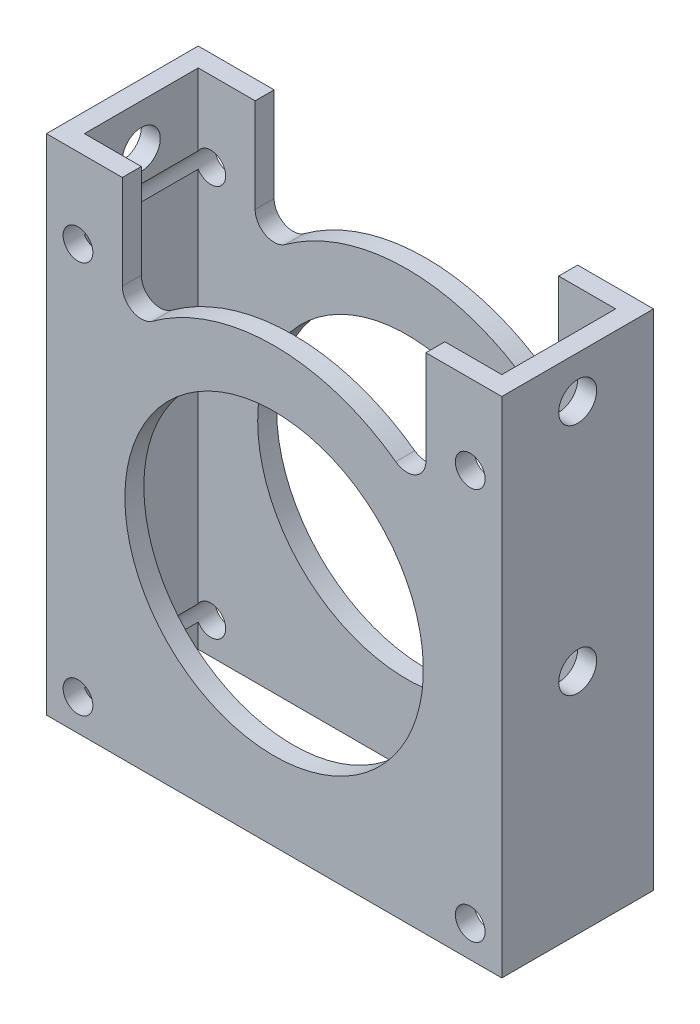
ISO-10303-21;
HEADER;
FILE_DESCRIPTION(('STEP AP214'),'2;1');
FILE_NAME('part.step','',(''),(''),'','','');
FILE_SCHEMA(('AUTOMOTIVE_DESIGN { 1 0 10303 214 1 1 1 1 }'));
ENDSEC;
DATA;
#1=APPLICATION_CONTEXT('core data for automotive mechanical design processes');
#2=APPLICATION_PROTOCOL_DEFINITION('international standard','automotive_design',2000,#1);
#3=PRODUCT_CONTEXT('',#1,'mechanical');
#4=PRODUCT('Part','Part','',(#3));
#5=PRODUCT_RELATED_PRODUCT_CATEGORY('part','',(#4));
#6=PRODUCT_DEFINITION_FORMATION('','',#4);
#7=PRODUCT_DEFINITION_CONTEXT('part definition',#1,'design');
#8=PRODUCT_DEFINITION('design','',#6,#7);
#9=PRODUCT_DEFINITION_SHAPE('','',#8);
#10=(LENGTH_UNIT() NAMED_UNIT(*) SI_UNIT(.MILLI.,.METRE.));
#11=(NAMED_UNIT(*) PLANE_ANGLE_UNIT() SI_UNIT($,.RADIAN.));
#12=(NAMED_UNIT(*) SI_UNIT($,.STERADIAN.) SOLID_ANGLE_UNIT());
#13=UNCERTAINTY_MEASURE_WITH_UNIT(LENGTH_MEASURE(1.E-05),#10,'distance_accuracy_value','');
#14=(GEOMETRIC_REPRESENTATION_CONTEXT(3) GLOBAL_UNCERTAINTY_ASSIGNED_CONTEXT((#13)) GLOBAL_UNIT_ASSIGNED_CONTEXT((#10,
#11,#12)) REPRESENTATION_CONTEXT('',''));
#15=CARTESIAN_POINT('',(0.,0.,0.));
#16=DIRECTION('',(0.,0.,1.));
#17=DIRECTION('',(1.,0.,0.));
#18=AXIS2_PLACEMENT_3D('',#15,#16,#17);
#19=CARTESIAN_POINT('',(3.175,49.276,0.));
#20=DIRECTION('',(1.,0.,0.));
#21=DIRECTION('',(0.,0.,-1.));
#22=AXIS2_PLACEMENT_3D('',#19,#20,#21);
#23=PLANE('',#22);
#24=DIRECTION('',(0.,-1.,0.));
#25=VECTOR('',#24,1.);
#26=CARTESIAN_POINT('',(3.175,49.276,-22.225));
#27=LINE('',#26,#25);
#28=CARTESIAN_POINT('',(3.175,-45.3162838117635,-22.225));
#29=VERTEX_POINT('',#28);
#30=CARTESIAN_POINT('',(3.175,-49.276,-22.225));
#31=VERTEX_POINT('',#30);
#32=EDGE_CURVE('E274',#29,#31,#27,.T.);
#33=ORIENTED_EDGE('',*,*,#32,.F.);
#34=DIRECTION('',(0.,0.,-1.));
#35=VECTOR('',#34,1.);
#36=CARTESIAN_POINT('',(3.175,-45.3162838117635,27.178));
#37=LINE('',#36,#35);
#38=CARTESIAN_POINT('',(3.175,-45.3162838117635,-3.175));
#39=VERTEX_POINT('',#38);
#40=EDGE_CURVE('E86',#29,#39,#37,.F.);
#41=ORIENTED_EDGE('',*,*,#40,.T.);
#42=DIRECTION('',(0.,-1.,0.));
#43=VECTOR('',#42,1.);
#44=CARTESIAN_POINT('',(3.175,49.276,-3.175));
#45=LINE('',#44,#43);
#46=CARTESIAN_POINT('',(3.175,-49.276,-3.175));
#47=VERTEX_POINT('',#46);
#48=EDGE_CURVE('E293',#39,#47,#45,.T.);
#49=ORIENTED_EDGE('',*,*,#48,.T.);
#50=DIRECTION('',(0.,0.,1.));
#51=VECTOR('',#50,1.);
#52=CARTESIAN_POINT('',(3.175,-49.276,0.));
#53=LINE('',#52,#51);
#54=EDGE_CURVE('E545',#31,#47,#53,.T.);
#55=ORIENTED_EDGE('',*,*,#54,.F.);
#56=EDGE_LOOP('',(#33,#41,#49,#55));
#57=FACE_BOUND('',#56,.T.);
#58=ADVANCED_FACE('F63',(#57),#23,.T.);
#59=CARTESIAN_POINT('',(3.175,-11.176,-12.7));
#60=DIRECTION('',(1.,0.,0.));
#61=DIRECTION('',(0.,0.,-1.));
#62=AXIS2_PLACEMENT_3D('',#59,#60,#61);
#63=CIRCLE('',#62,3.175);
#64=CARTESIAN_POINT('',(3.175,-11.176,-15.875));
#65=VERTEX_POINT('',#64);
#66=EDGE_CURVE('E763',#65,#65,#63,.T.);
#67=ORIENTED_EDGE('',*,*,#66,.F.);
#68=EDGE_LOOP('',(#67));
#69=FACE_BOUND('',#68,.T.);
#70=CARTESIAN_POINT('',(3.175,20.3173161882365,-3.175));
#71=VERTEX_POINT('',#70);
#72=CARTESIAN_POINT('',(3.175,-42.6693161882365,-3.175));
#73=VERTEX_POINT('',#72);
#74=EDGE_CURVE('E262',#71,#73,#45,.T.);
#75=ORIENTED_EDGE('',*,*,#74,.T.);
#76=DIRECTION('',(0.,0.,-1.));
#77=VECTOR('',#76,1.);
#78=CARTESIAN_POINT('',(3.175,-42.6693161882365,27.178));
#79=LINE('',#78,#77);
#80=CARTESIAN_POINT('',(3.175,-42.6693161882365,-22.225));
#81=VERTEX_POINT('',#80);
#82=EDGE_CURVE('E248',#73,#81,#79,.T.);
#83=ORIENTED_EDGE('',*,*,#82,.T.);
#84=CARTESIAN_POINT('',(3.175,20.3173161882365,-22.225));
#85=VERTEX_POINT('',#84);
#86=EDGE_CURVE('E260',#85,#81,#27,.T.);
#87=ORIENTED_EDGE('',*,*,#86,.F.);
#88=DIRECTION('',(0.,0.,-1.));
#89=VECTOR('',#88,1.);
#90=CARTESIAN_POINT('',(3.175,20.3173161882365,27.178));
#91=LINE('',#90,#89);
#92=EDGE_CURVE('E535',#71,#85,#91,.T.);
#93=ORIENTED_EDGE('',*,*,#92,.F.);
#94=EDGE_LOOP('',(#75,#83,#87,#93));
#95=FACE_BOUND('',#94,.T.);
#96=ADVANCED_FACE('F258',(#69,#95),#23,.T.);
#97=CARTESIAN_POINT('',(73.025,49.276,0.));
#98=DIRECTION('',(-1.,0.,0.));
#99=DIRECTION('',(0.,0.,1.));
#100=AXIS2_PLACEMENT_3D('',#97,#98,#99);
#101=PLANE('',#100);
#102=CARTESIAN_POINT('',(73.025,27.94,-12.7));
#103=DIRECTION('',(-1.,0.,0.));
#104=DIRECTION('',(0.,0.,1.));
#105=AXIS2_PLACEMENT_3D('',#102,#103,#104);
#106=CIRCLE('',#105,3.175);
#107=CARTESIAN_POINT('',(73.025,27.94,-9.525));
#108=VERTEX_POINT('',#107);
#109=EDGE_CURVE('E364',#108,#108,#106,.T.);
#110=ORIENTED_EDGE('',*,*,#109,.F.);
#111=EDGE_LOOP('',(#110));
#112=FACE_BOUND('',#111,.T.);
#113=DIRECTION('',(0.,-1.,0.));
#114=VECTOR('',#113,1.);
#115=CARTESIAN_POINT('',(73.025,49.276,-22.225));
#116=LINE('',#115,#114);
#117=CARTESIAN_POINT('',(73.025,34.9885,-22.225));
#118=VERTEX_POINT('',#117);
#119=CARTESIAN_POINT('',(73.025,22.9642838117635,-22.225));
#120=VERTEX_POINT('',#119);
#121=EDGE_CURVE('E283',#118,#120,#116,.T.);
#122=ORIENTED_EDGE('',*,*,#121,.T.);
#123=DIRECTION('',(0.,0.,-1.));
#124=VECTOR('',#123,1.);
#125=CARTESIAN_POINT('',(73.025,22.9642838117635,27.178));
#126=LINE('',#125,#124);
#127=CARTESIAN_POINT('',(73.025,22.9642838117635,-3.175));
#128=VERTEX_POINT('',#127);
#129=EDGE_CURVE('E79',#120,#128,#126,.F.);
#130=ORIENTED_EDGE('',*,*,#129,.T.);
#131=DIRECTION('',(0.,-1.,0.));
#132=VECTOR('',#131,1.);
#133=CARTESIAN_POINT('',(73.025,49.276,-3.175));
#134=LINE('',#133,#132);
#135=CARTESIAN_POINT('',(73.025,34.9885,-3.175));
#136=VERTEX_POINT('',#135);
#137=EDGE_CURVE('E289',#136,#128,#134,.T.);
#138=ORIENTED_EDGE('',*,*,#137,.F.);
#139=DIRECTION('',(0.,0.,1.));
#140=VECTOR('',#139,1.);
#141=CARTESIAN_POINT('',(73.025,34.9885,0.));
#142=LINE('',#141,#140);
#143=EDGE_CURVE('E435',#118,#136,#142,.T.);
#144=ORIENTED_EDGE('',*,*,#143,.F.);
#145=EDGE_LOOP('',(#122,#130,#138,#144));
#146=FACE_BOUND('',#145,.T.);
#147=ADVANCED_FACE('F669',(#112,#146),#101,.T.);
#148=CARTESIAN_POINT('',(73.025,-11.176,-12.7));
#149=DIRECTION('',(-1.,0.,0.));
#150=DIRECTION('',(0.,0.,1.));
#151=AXIS2_PLACEMENT_3D('',#148,#149,#150);
#152=CIRCLE('',#151,3.175);
#153=CARTESIAN_POINT('',(73.025,-11.176,-9.525));
#154=VERTEX_POINT('',#153);
#155=EDGE_CURVE('E760',#154,#154,#152,.T.);
#156=ORIENTED_EDGE('',*,*,#155,.F.);
#157=EDGE_LOOP('',(#156));
#158=FACE_BOUND('',#157,.T.);
#159=CARTESIAN_POINT('',(73.025,20.3173161882365,-3.175));
#160=VERTEX_POINT('',#159);
#161=CARTESIAN_POINT('',(73.025,-42.6693161882365,-3.175));
#162=VERTEX_POINT('',#161);
#163=EDGE_CURVE('E294',#160,#162,#134,.T.);
#164=ORIENTED_EDGE('',*,*,#163,.F.);
#165=DIRECTION('',(0.,0.,-1.));
#166=VECTOR('',#165,1.);
#167=CARTESIAN_POINT('',(73.025,20.3173161882365,27.178));
#168=LINE('',#167,#166);
#169=CARTESIAN_POINT('',(73.025,20.3173161882365,-22.225));
#170=VERTEX_POINT('',#169);
#171=EDGE_CURVE('E584',#160,#170,#168,.T.);
#172=ORIENTED_EDGE('',*,*,#171,.T.);
#173=CARTESIAN_POINT('',(73.025,-42.6693161882365,-22.225));
#174=VERTEX_POINT('',#173);
#175=EDGE_CURVE('E288',#170,#174,#116,.T.);
#176=ORIENTED_EDGE('',*,*,#175,.T.);
#177=DIRECTION('',(0.,0.,-1.));
#178=VECTOR('',#177,1.);
#179=CARTESIAN_POINT('',(73.025,-42.6693161882365,27.178));
#180=LINE('',#179,#178);
#181=EDGE_CURVE('E513',#162,#174,#180,.T.);
#182=ORIENTED_EDGE('',*,*,#181,.F.);
#183=EDGE_LOOP('',(#164,#172,#176,#182));
#184=FACE_BOUND('',#183,.T.);
#185=ADVANCED_FACE('F583',(#158,#184),#101,.T.);
#186=CARTESIAN_POINT('',(0.,-49.276,0.));
#187=DIRECTION('',(0.,1.,0.));
#188=DIRECTION('',(0.,0.,1.));
#189=AXIS2_PLACEMENT_3D('',#186,#187,#188);
#190=PLANE('',#189);
#191=DIRECTION('',(0.,0.,1.));
#192=VECTOR('',#191,1.);
#193=CARTESIAN_POINT('',(0.,-49.276,0.));
#194=LINE('',#193,#192);
#195=CARTESIAN_POINT('',(0.,-49.276,-25.4));
#196=VERTEX_POINT('',#195);
#197=CARTESIAN_POINT('',(0.,-49.276,0.));
#198=VERTEX_POINT('',#197);
#199=EDGE_CURVE('E298',#196,#198,#194,.T.);
#200=ORIENTED_EDGE('',*,*,#199,.F.);
#201=DIRECTION('',(-1.,0.,0.));
#202=VECTOR('',#201,1.);
#203=CARTESIAN_POINT('',(0.,-49.276,-25.4));
#204=LINE('',#203,#202);
#205=CARTESIAN_POINT('',(76.2,-49.276,-25.4));
#206=VERTEX_POINT('',#205);
#207=EDGE_CURVE('E310',#206,#196,#204,.T.);
#208=ORIENTED_EDGE('',*,*,#207,.F.);
#209=DIRECTION('',(0.,0.,-1.));
#210=VECTOR('',#209,1.);
#211=CARTESIAN_POINT('',(76.2,-49.276,0.));
#212=LINE('',#211,#210);
#213=CARTESIAN_POINT('',(76.2,-49.276,0.));
#214=VERTEX_POINT('',#213);
#215=EDGE_CURVE('E306',#214,#206,#212,.T.);
#216=ORIENTED_EDGE('',*,*,#215,.F.);
#217=DIRECTION('',(1.,0.,0.));
#218=VECTOR('',#217,1.);
#219=CARTESIAN_POINT('',(0.,-49.276,0.));
#220=LINE('',#219,#218);
#221=EDGE_CURVE('E302',#198,#214,#220,.T.);
#222=ORIENTED_EDGE('',*,*,#221,.F.);
#223=EDGE_LOOP('',(#200,#208,#216,#222));
#224=FACE_BOUND('',#223,.T.);
#225=ORIENTED_EDGE('',*,*,#54,.T.);
#226=DIRECTION('',(1.,0.,0.));
#227=VECTOR('',#226,1.);
#228=CARTESIAN_POINT('',(0.,-49.276,-3.175));
#229=LINE('',#228,#227);
#230=CARTESIAN_POINT('',(73.025,-49.276,-3.175));
#231=VERTEX_POINT('',#230);
#232=EDGE_CURVE('E549',#47,#231,#229,.T.);
#233=ORIENTED_EDGE('',*,*,#232,.T.);
#234=DIRECTION('',(0.,0.,-1.));
#235=VECTOR('',#234,1.);
#236=CARTESIAN_POINT('',(73.025,-49.276,0.));
#237=LINE('',#236,#235);
#238=CARTESIAN_POINT('',(73.025,-49.276,-22.225));
#239=VERTEX_POINT('',#238);
#240=EDGE_CURVE('E552',#231,#239,#237,.T.);
#241=ORIENTED_EDGE('',*,*,#240,.T.);
#242=DIRECTION('',(-1.,0.,0.));
#243=VECTOR('',#242,1.);
#244=CARTESIAN_POINT('',(0.,-49.276,-22.225));
#245=LINE('',#244,#243);
#246=EDGE_CURVE('E279',#239,#31,#245,.T.);
#247=ORIENTED_EDGE('',*,*,#246,.T.);
#248=EDGE_LOOP('',(#225,#233,#241,#247));
#249=FACE_BOUND('',#248,.T.);
#250=ADVANCED_FACE('F560',(#224,#249),#190,.F.);
#251=CARTESIAN_POINT('',(0.,49.276,0.));
#252=DIRECTION('',(1.,0.,0.));
#253=DIRECTION('',(0.,0.,-1.));
#254=AXIS2_PLACEMENT_3D('',#251,#252,#253);
#255=PLANE('',#254);
#256=CARTESIAN_POINT('',(0.,-11.176,-12.7));
#257=DIRECTION('',(-1.,0.,0.));
#258=DIRECTION('',(0.,0.,1.));
#259=AXIS2_PLACEMENT_3D('',#256,#257,#258);
#260=CIRCLE('',#259,3.175);
#261=CARTESIAN_POINT('',(0.,-11.176,-9.525));
#262=VERTEX_POINT('',#261);
#263=EDGE_CURVE('E772',#262,#262,#260,.T.);
#264=ORIENTED_EDGE('',*,*,#263,.F.);
#265=EDGE_LOOP('',(#264));
#266=FACE_BOUND('',#265,.T.);
#267=CARTESIAN_POINT('',(0.,27.94,-12.7));
#268=DIRECTION('',(-1.,0.,0.));
#269=DIRECTION('',(0.,0.,1.));
#270=AXIS2_PLACEMENT_3D('',#267,#268,#269);
#271=CIRCLE('',#270,3.175);
#272=CARTESIAN_POINT('',(0.,27.94,-9.525));
#273=VERTEX_POINT('',#272);
#274=EDGE_CURVE('E374',#273,#273,#271,.T.);
#275=ORIENTED_EDGE('',*,*,#274,.F.);
#276=EDGE_LOOP('',(#275));
#277=FACE_BOUND('',#276,.T.);
#278=DIRECTION('',(0.,-1.,0.));
#279=VECTOR('',#278,1.);
#280=CARTESIAN_POINT('',(0.,49.276,0.));
#281=LINE('',#280,#279);
#282=CARTESIAN_POINT('',(0.,34.9885,0.));
#283=VERTEX_POINT('',#282);
#284=EDGE_CURVE('E323',#283,#198,#281,.T.);
#285=ORIENTED_EDGE('',*,*,#284,.F.);
#286=DIRECTION('',(0.,0.,-1.));
#287=VECTOR('',#286,1.);
#288=CARTESIAN_POINT('',(0.,34.9885,0.));
#289=LINE('',#288,#287);
#290=CARTESIAN_POINT('',(0.,34.9885,-25.4));
#291=VERTEX_POINT('',#290);
#292=EDGE_CURVE('E431',#283,#291,#289,.T.);
#293=ORIENTED_EDGE('',*,*,#292,.T.);
#294=DIRECTION('',(0.,-1.,0.));
#295=VECTOR('',#294,1.);
#296=CARTESIAN_POINT('',(0.,49.276,-25.4));
#297=LINE('',#296,#295);
#298=EDGE_CURVE('E314',#291,#196,#297,.T.);
#299=ORIENTED_EDGE('',*,*,#298,.T.);
#300=ORIENTED_EDGE('',*,*,#199,.T.);
#301=EDGE_LOOP('',(#285,#293,#299,#300));
#302=FACE_BOUND('',#301,.T.);
#303=ADVANCED_FACE('F65',(#266,#277,#302),#255,.F.);
#304=CARTESIAN_POINT('',(0.,49.276,0.));
#305=DIRECTION('',(0.,0.,-1.));
#306=DIRECTION('',(-1.,0.,0.));
#307=AXIS2_PLACEMENT_3D('',#304,#305,#306);
#308=PLANE('',#307);
#309=CARTESIAN_POINT('',(70.9168,21.6408,0.));
#310=DIRECTION('',(0.,0.,-1.));
#311=DIRECTION('',(-1.,0.,0.));
#312=AXIS2_PLACEMENT_3D('',#309,#310,#311);
#313=CIRCLE('',#312,2.4892);
#314=CARTESIAN_POINT('',(68.4276,21.6408,0.));
#315=VERTEX_POINT('',#314);
#316=EDGE_CURVE('E380',#315,#315,#313,.F.);
#317=ORIENTED_EDGE('',*,*,#316,.F.);
#318=EDGE_LOOP('',(#317));
#319=FACE_BOUND('',#318,.T.);
#320=CARTESIAN_POINT('',(5.2832,-43.9928,0.));
#321=DIRECTION('',(0.,0.,-1.));
#322=DIRECTION('',(-1.,0.,0.));
#323=AXIS2_PLACEMENT_3D('',#320,#321,#322);
#324=CIRCLE('',#323,2.4892);
#325=CARTESIAN_POINT('',(2.794,-43.9928,0.));
#326=VERTEX_POINT('',#325);
#327=EDGE_CURVE('E787',#326,#326,#324,.F.);
#328=ORIENTED_EDGE('',*,*,#327,.F.);
#329=EDGE_LOOP('',(#328));
#330=FACE_BOUND('',#329,.T.);
#331=CARTESIAN_POINT('',(5.2832,21.6408,0.));
#332=DIRECTION('',(0.,0.,-1.));
#333=DIRECTION('',(-1.,0.,0.));
#334=AXIS2_PLACEMENT_3D('',#331,#332,#333);
#335=CIRCLE('',#334,2.4892);
#336=CARTESIAN_POINT('',(2.794,21.6408,0.));
#337=VERTEX_POINT('',#336);
#338=EDGE_CURVE('E541',#337,#337,#335,.T.);
#339=ORIENTED_EDGE('',*,*,#338,.T.);
#340=EDGE_LOOP('',(#339));
#341=FACE_BOUND('',#340,.T.);
#342=CARTESIAN_POINT('',(38.1,-11.176,0.));
#343=DIRECTION('',(0.,0.,-1.));
#344=DIRECTION('',(-1.,0.,0.));
#345=AXIS2_PLACEMENT_3D('',#342,#343,#344);
#346=CIRCLE('',#345,24.97201);
#347=CARTESIAN_POINT('',(13.12799,-11.176,0.));
#348=VERTEX_POINT('',#347);
#349=EDGE_CURVE('E527',#348,#348,#346,.T.);
#350=ORIENTED_EDGE('',*,*,#349,.T.);
#351=EDGE_LOOP('',(#350));
#352=FACE_BOUND('',#351,.T.);
#353=CARTESIAN_POINT('',(70.9168,-43.9928,0.));
#354=DIRECTION('',(0.,0.,-1.));
#355=DIRECTION('',(-1.,0.,0.));
#356=AXIS2_PLACEMENT_3D('',#353,#354,#355);
#357=CIRCLE('',#356,2.4892);
#358=CARTESIAN_POINT('',(68.4276,-43.9928,0.));
#359=VERTEX_POINT('',#358);
#360=EDGE_CURVE('E334',#359,#359,#357,.T.);
#361=ORIENTED_EDGE('',*,*,#360,.T.);
#362=EDGE_LOOP('',(#361));
#363=FACE_BOUND('',#362,.T.);
#364=DIRECTION('',(0.,-1.,0.));
#365=VECTOR('',#364,1.);
#366=CARTESIAN_POINT('',(12.7,0.,0.));
#367=LINE('',#366,#365);
#368=CARTESIAN_POINT('',(12.7,34.9885,0.));
#369=VERTEX_POINT('',#368);
#370=CARTESIAN_POINT('',(12.7,19.2415888663139,0.));
#371=VERTEX_POINT('',#370);
#372=EDGE_CURVE('E405',#369,#371,#367,.T.);
#373=ORIENTED_EDGE('',*,*,#372,.F.);
#374=DIRECTION('',(-1.,0.,0.));
#375=VECTOR('',#374,1.);
#376=CARTESIAN_POINT('',(0.,34.9885,0.));
#377=LINE('',#376,#375);
#378=EDGE_CURVE('E391',#369,#283,#377,.T.);
#379=ORIENTED_EDGE('',*,*,#378,.T.);
#380=ORIENTED_EDGE('',*,*,#284,.T.);
#381=ORIENTED_EDGE('',*,*,#221,.T.);
#382=DIRECTION('',(0.,-1.,0.));
#383=VECTOR('',#382,1.);
#384=CARTESIAN_POINT('',(76.2,49.276,0.));
#385=LINE('',#384,#383);
#386=CARTESIAN_POINT('',(76.2,34.9885,0.));
#387=VERTEX_POINT('',#386);
#388=EDGE_CURVE('E320',#387,#214,#385,.T.);
#389=ORIENTED_EDGE('',*,*,#388,.F.);
#390=CARTESIAN_POINT('',(63.5,34.9885,0.));
#391=VERTEX_POINT('',#390);
#392=EDGE_CURVE('E385',#387,#391,#377,.T.);
#393=ORIENTED_EDGE('',*,*,#392,.T.);
#394=DIRECTION('',(0.,-1.,0.));
#395=VECTOR('',#394,1.);
#396=CARTESIAN_POINT('',(63.5,0.,0.));
#397=LINE('',#396,#395);
#398=CARTESIAN_POINT('',(63.5,19.2415888663139,0.));
#399=VERTEX_POINT('',#398);
#400=EDGE_CURVE('E389',#391,#399,#397,.T.);
#401=ORIENTED_EDGE('',*,*,#400,.T.);
#402=CARTESIAN_POINT('',(60.325,19.2415888663139,0.));
#403=DIRECTION('',(0.,0.,-1.));
#404=DIRECTION('',(-1.,0.,0.));
#405=AXIS2_PLACEMENT_3D('',#402,#403,#404);
#406=CIRCLE('',#405,3.17499999999999);
#407=CARTESIAN_POINT('',(58.4518752317702,16.6779920566255,0.));
#408=VERTEX_POINT('',#407);
#409=EDGE_CURVE('E395',#408,#399,#406,.F.);
#410=ORIENTED_EDGE('',*,*,#409,.F.);
#411=CARTESIAN_POINT('',(38.1,-11.176,0.));
#412=DIRECTION('',(0.,0.,-1.));
#413=DIRECTION('',(-1.,0.,0.));
#414=AXIS2_PLACEMENT_3D('',#411,#412,#413);
#415=CIRCLE('',#414,34.49701);
#416=CARTESIAN_POINT('',(17.7481247682298,16.6779920566255,0.));
#417=VERTEX_POINT('',#416);
#418=EDGE_CURVE('E398',#417,#408,#415,.T.);
#419=ORIENTED_EDGE('',*,*,#418,.F.);
#420=CARTESIAN_POINT('',(15.875,19.2415888663139,0.));
#421=DIRECTION('',(0.,0.,-1.));
#422=DIRECTION('',(-1.,0.,0.));
#423=AXIS2_PLACEMENT_3D('',#420,#421,#422);
#424=CIRCLE('',#423,3.175);
#425=EDGE_CURVE('E401',#417,#371,#424,.T.);
#426=ORIENTED_EDGE('',*,*,#425,.T.);
#427=EDGE_LOOP('',(#373,#379,#380,#381,#389,#393,#401,#410,#419,#426));
#428=FACE_BOUND('',#427,.T.);
#429=ADVANCED_FACE('F594',(#319,#330,#341,#352,#363,#428),#308,.F.);
#430=CARTESIAN_POINT('',(76.2,49.276,0.));
#431=DIRECTION('',(-1.,0.,0.));
#432=DIRECTION('',(0.,0.,1.));
#433=AXIS2_PLACEMENT_3D('',#430,#431,#432);
#434=PLANE('',#433);
#435=CARTESIAN_POINT('',(76.2,-11.176,-12.7));
#436=DIRECTION('',(-1.,0.,0.));
#437=DIRECTION('',(0.,0.,1.));
#438=AXIS2_PLACEMENT_3D('',#435,#436,#437);
#439=CIRCLE('',#438,3.175);
#440=CARTESIAN_POINT('',(76.2,-11.176,-9.525));
#441=VERTEX_POINT('',#440);
#442=EDGE_CURVE('E764',#441,#441,#439,.T.);
#443=ORIENTED_EDGE('',*,*,#442,.T.);
#444=EDGE_LOOP('',(#443));
#445=FACE_BOUND('',#444,.T.);
#446=CARTESIAN_POINT('',(76.2,27.94,-12.7));
#447=DIRECTION('',(-1.,0.,0.));
#448=DIRECTION('',(0.,0.,1.));
#449=AXIS2_PLACEMENT_3D('',#446,#447,#448);
#450=CIRCLE('',#449,3.175);
#451=CARTESIAN_POINT('',(76.2,27.94,-9.525));
#452=VERTEX_POINT('',#451);
#453=EDGE_CURVE('E365',#452,#452,#450,.T.);
#454=ORIENTED_EDGE('',*,*,#453,.T.);
#455=EDGE_LOOP('',(#454));
#456=FACE_BOUND('',#455,.T.);
#457=DIRECTION('',(0.,-1.,0.));
#458=VECTOR('',#457,1.);
#459=CARTESIAN_POINT('',(76.2,49.276,-25.4));
#460=LINE('',#459,#458);
#461=CARTESIAN_POINT('',(76.2,34.9885,-25.4));
#462=VERTEX_POINT('',#461);
#463=EDGE_CURVE('E317',#462,#206,#460,.T.);
#464=ORIENTED_EDGE('',*,*,#463,.F.);
#465=DIRECTION('',(0.,0.,-1.));
#466=VECTOR('',#465,1.);
#467=CARTESIAN_POINT('',(76.2,34.9885,0.));
#468=LINE('',#467,#466);
#469=EDGE_CURVE('E466',#387,#462,#468,.T.);
#470=ORIENTED_EDGE('',*,*,#469,.F.);
#471=ORIENTED_EDGE('',*,*,#388,.T.);
#472=ORIENTED_EDGE('',*,*,#215,.T.);
#473=EDGE_LOOP('',(#464,#470,#471,#472));
#474=FACE_BOUND('',#473,.T.);
#475=ADVANCED_FACE('F597',(#445,#456,#474),#434,.F.);
#476=CARTESIAN_POINT('',(0.,49.276,-25.4));
#477=DIRECTION('',(0.,0.,1.));
#478=DIRECTION('',(1.,0.,0.));
#479=AXIS2_PLACEMENT_3D('',#476,#477,#478);
#480=PLANE('',#479);
#481=CARTESIAN_POINT('',(70.9168,21.6408,-25.4));
#482=DIRECTION('',(0.,0.,1.));
#483=DIRECTION('',(1.,0.,0.));
#484=AXIS2_PLACEMENT_3D('',#481,#482,#483);
#485=CIRCLE('',#484,2.4892);
#486=CARTESIAN_POINT('',(73.406,21.6408,-25.4));
#487=VERTEX_POINT('',#486);
#488=EDGE_CURVE('E264',#487,#487,#485,.T.);
#489=ORIENTED_EDGE('',*,*,#488,.T.);
#490=EDGE_LOOP('',(#489));
#491=FACE_BOUND('',#490,.T.);
#492=CARTESIAN_POINT('',(5.2832,-43.9928,-25.4));
#493=DIRECTION('',(0.,0.,1.));
#494=DIRECTION('',(1.,0.,0.));
#495=AXIS2_PLACEMENT_3D('',#492,#493,#494);
#496=CIRCLE('',#495,2.4892);
#497=CARTESIAN_POINT('',(7.77240000000001,-43.9928,-25.4));
#498=VERTEX_POINT('',#497);
#499=EDGE_CURVE('E769',#498,#498,#496,.T.);
#500=ORIENTED_EDGE('',*,*,#499,.T.);
#501=EDGE_LOOP('',(#500));
#502=FACE_BOUND('',#501,.T.);
#503=CARTESIAN_POINT('',(5.2832,21.6408,-25.4));
#504=DIRECTION('',(0.,0.,-1.));
#505=DIRECTION('',(-1.,0.,0.));
#506=AXIS2_PLACEMENT_3D('',#503,#504,#505);
#507=CIRCLE('',#506,2.4892);
#508=CARTESIAN_POINT('',(2.794,21.6408,-25.4));
#509=VERTEX_POINT('',#508);
#510=EDGE_CURVE('E499',#509,#509,#507,.T.);
#511=ORIENTED_EDGE('',*,*,#510,.F.);
#512=EDGE_LOOP('',(#511));
#513=FACE_BOUND('',#512,.T.);
#514=CARTESIAN_POINT('',(38.1,-11.176,-25.4));
#515=DIRECTION('',(0.,0.,-1.));
#516=DIRECTION('',(-1.,0.,0.));
#517=AXIS2_PLACEMENT_3D('',#514,#515,#516);
#518=CIRCLE('',#517,24.97201);
#519=CARTESIAN_POINT('',(13.12799,-11.176,-25.4));
#520=VERTEX_POINT('',#519);
#521=EDGE_CURVE('E504',#520,#520,#518,.T.);
#522=ORIENTED_EDGE('',*,*,#521,.F.);
#523=EDGE_LOOP('',(#522));
#524=FACE_BOUND('',#523,.T.);
#525=CARTESIAN_POINT('',(70.9168,-43.9928,-25.4));
#526=DIRECTION('',(0.,0.,-1.));
#527=DIRECTION('',(-1.,0.,0.));
#528=AXIS2_PLACEMENT_3D('',#525,#526,#527);
#529=CIRCLE('',#528,2.4892);
#530=CARTESIAN_POINT('',(68.4276,-43.9928,-25.4));
#531=VERTEX_POINT('',#530);
#532=EDGE_CURVE('E498',#531,#531,#529,.T.);
#533=ORIENTED_EDGE('',*,*,#532,.F.);
#534=EDGE_LOOP('',(#533));
#535=FACE_BOUND('',#534,.T.);
#536=ORIENTED_EDGE('',*,*,#298,.F.);
#537=DIRECTION('',(-1.,0.,0.));
#538=VECTOR('',#537,1.);
#539=CARTESIAN_POINT('',(0.,34.9885,-25.4));
#540=LINE('',#539,#538);
#541=CARTESIAN_POINT('',(12.7,34.9885,-25.4));
#542=VERTEX_POINT('',#541);
#543=EDGE_CURVE('E390',#542,#291,#540,.T.);
#544=ORIENTED_EDGE('',*,*,#543,.F.);
#545=DIRECTION('',(0.,-1.,0.));
#546=VECTOR('',#545,1.);
#547=CARTESIAN_POINT('',(12.7,0.,-25.4));
#548=LINE('',#547,#546);
#549=CARTESIAN_POINT('',(12.7,19.2415888663139,-25.4));
#550=VERTEX_POINT('',#549);
#551=EDGE_CURVE('E427',#542,#550,#548,.T.);
#552=ORIENTED_EDGE('',*,*,#551,.T.);
#553=CARTESIAN_POINT('',(15.875,19.2415888663139,-25.4));
#554=DIRECTION('',(0.,0.,-1.));
#555=DIRECTION('',(-1.,0.,0.));
#556=AXIS2_PLACEMENT_3D('',#553,#554,#555);
#557=CIRCLE('',#556,3.175);
#558=CARTESIAN_POINT('',(17.7481247682298,16.6779920566255,-25.4));
#559=VERTEX_POINT('',#558);
#560=EDGE_CURVE('E423',#559,#550,#557,.T.);
#561=ORIENTED_EDGE('',*,*,#560,.F.);
#562=CARTESIAN_POINT('',(38.1,-11.176,-25.4));
#563=DIRECTION('',(0.,0.,-1.));
#564=DIRECTION('',(-1.,0.,0.));
#565=AXIS2_PLACEMENT_3D('',#562,#563,#564);
#566=CIRCLE('',#565,34.49701);
#567=CARTESIAN_POINT('',(58.4518752317702,16.6779920566255,-25.4));
#568=VERTEX_POINT('',#567);
#569=EDGE_CURVE('E419',#559,#568,#566,.T.);
#570=ORIENTED_EDGE('',*,*,#569,.T.);
#571=CARTESIAN_POINT('',(60.325,19.2415888663139,-25.4));
#572=DIRECTION('',(0.,0.,-1.));
#573=DIRECTION('',(-1.,0.,0.));
#574=AXIS2_PLACEMENT_3D('',#571,#572,#573);
#575=CIRCLE('',#574,3.17499999999999);
#576=CARTESIAN_POINT('',(63.5,19.2415888663139,-25.4));
#577=VERTEX_POINT('',#576);
#578=EDGE_CURVE('E415',#568,#577,#575,.F.);
#579=ORIENTED_EDGE('',*,*,#578,.T.);
#580=DIRECTION('',(0.,-1.,0.));
#581=VECTOR('',#580,1.);
#582=CARTESIAN_POINT('',(63.5,0.,-25.4));
#583=LINE('',#582,#581);
#584=CARTESIAN_POINT('',(63.5,34.9885,-25.4));
#585=VERTEX_POINT('',#584);
#586=EDGE_CURVE('E411',#585,#577,#583,.T.);
#587=ORIENTED_EDGE('',*,*,#586,.F.);
#588=EDGE_CURVE('E371',#462,#585,#540,.T.);
#589=ORIENTED_EDGE('',*,*,#588,.F.);
#590=ORIENTED_EDGE('',*,*,#463,.T.);
#591=ORIENTED_EDGE('',*,*,#207,.T.);
#592=EDGE_LOOP('',(#536,#544,#552,#561,#570,#579,#587,#589,#590,#591));
#593=FACE_BOUND('',#592,.T.);
#594=ADVANCED_FACE('F625',(#491,#502,#513,#524,#535,#593),#480,.F.);
#595=CARTESIAN_POINT('',(3.175,27.94,-12.7));
#596=DIRECTION('',(1.,0.,0.));
#597=DIRECTION('',(0.,0.,-1.));
#598=AXIS2_PLACEMENT_3D('',#595,#596,#597);
#599=CIRCLE('',#598,3.175);
#600=CARTESIAN_POINT('',(3.175,27.94,-15.875));
#601=VERTEX_POINT('',#600);
#602=EDGE_CURVE('E361',#601,#601,#599,.T.);
#603=ORIENTED_EDGE('',*,*,#602,.F.);
#604=EDGE_LOOP('',(#603));
#605=FACE_BOUND('',#604,.T.);
#606=DIRECTION('',(0.,0.,-1.));
#607=VECTOR('',#606,1.);
#608=CARTESIAN_POINT('',(3.175,34.9885,0.));
#609=LINE('',#608,#607);
#610=CARTESIAN_POINT('',(3.175,34.9885,-3.175));
#611=VERTEX_POINT('',#610);
#612=CARTESIAN_POINT('',(3.175,34.9885,-22.225));
#613=VERTEX_POINT('',#612);
#614=EDGE_CURVE('E492',#611,#613,#609,.T.);
#615=ORIENTED_EDGE('',*,*,#614,.F.);
#616=CARTESIAN_POINT('',(3.175,22.9642838117635,-3.175));
#617=VERTEX_POINT('',#616);
#618=EDGE_CURVE('E295',#611,#617,#45,.T.);
#619=ORIENTED_EDGE('',*,*,#618,.T.);
#620=DIRECTION('',(0.,0.,-1.));
#621=VECTOR('',#620,1.);
#622=CARTESIAN_POINT('',(3.175,22.9642838117635,27.178));
#623=LINE('',#622,#621);
#624=CARTESIAN_POINT('',(3.175,22.9642838117635,-22.225));
#625=VERTEX_POINT('',#624);
#626=EDGE_CURVE('E531',#625,#617,#623,.F.);
#627=ORIENTED_EDGE('',*,*,#626,.F.);
#628=EDGE_CURVE('E273',#613,#625,#27,.T.);
#629=ORIENTED_EDGE('',*,*,#628,.F.);
#630=EDGE_LOOP('',(#615,#619,#627,#629));
#631=FACE_BOUND('',#630,.T.);
#632=ADVANCED_FACE('F694',(#605,#631),#23,.T.);
#633=CARTESIAN_POINT('',(0.,49.276,-3.175));
#634=DIRECTION('',(0.,0.,-1.));
#635=DIRECTION('',(-1.,0.,0.));
#636=AXIS2_PLACEMENT_3D('',#633,#634,#635);
#637=PLANE('',#636);
#638=ORIENTED_EDGE('',*,*,#137,.T.);
#639=CARTESIAN_POINT('',(70.9168,21.6408,-3.175));
#640=DIRECTION('',(0.,0.,-1.));
#641=DIRECTION('',(-1.,0.,0.));
#642=AXIS2_PLACEMENT_3D('',#639,#640,#641);
#643=CIRCLE('',#642,2.4892);
#644=EDGE_CURVE('E671',#128,#160,#643,.F.);
#645=ORIENTED_EDGE('',*,*,#644,.T.);
#646=ORIENTED_EDGE('',*,*,#163,.T.);
#647=CARTESIAN_POINT('',(70.9168,-43.9928,-3.175));
#648=DIRECTION('',(0.,0.,-1.));
#649=DIRECTION('',(-1.,0.,0.));
#650=AXIS2_PLACEMENT_3D('',#647,#648,#649);
#651=CIRCLE('',#650,2.4892);
#652=CARTESIAN_POINT('',(73.025,-45.3162838117635,-3.175));
#653=VERTEX_POINT('',#652);
#654=EDGE_CURVE('E517',#653,#162,#651,.T.);
#655=ORIENTED_EDGE('',*,*,#654,.F.);
#656=EDGE_CURVE('E287',#653,#231,#134,.T.);
#657=ORIENTED_EDGE('',*,*,#656,.T.);
#658=ORIENTED_EDGE('',*,*,#232,.F.);
#659=ORIENTED_EDGE('',*,*,#48,.F.);
#660=CARTESIAN_POINT('',(5.2832,-43.9928,-3.175));
#661=DIRECTION('',(0.,0.,-1.));
#662=DIRECTION('',(-1.,0.,0.));
#663=AXIS2_PLACEMENT_3D('',#660,#661,#662);
#664=CIRCLE('',#663,2.4892);
#665=EDGE_CURVE('E784',#39,#73,#664,.F.);
#666=ORIENTED_EDGE('',*,*,#665,.T.);
#667=ORIENTED_EDGE('',*,*,#74,.F.);
#668=CARTESIAN_POINT('',(5.2832,21.6408,-3.175));
#669=DIRECTION('',(0.,0.,-1.));
#670=DIRECTION('',(-1.,0.,0.));
#671=AXIS2_PLACEMENT_3D('',#668,#669,#670);
#672=CIRCLE('',#671,2.4892);
#673=EDGE_CURVE('E538',#617,#71,#672,.T.);
#674=ORIENTED_EDGE('',*,*,#673,.F.);
#675=ORIENTED_EDGE('',*,*,#618,.F.);
#676=DIRECTION('',(-1.,0.,0.));
#677=VECTOR('',#676,1.);
#678=CARTESIAN_POINT('',(0.,34.9885,-3.175));
#679=LINE('',#678,#677);
#680=CARTESIAN_POINT('',(12.7,34.9885,-3.175));
#681=VERTEX_POINT('',#680);
#682=EDGE_CURVE('E495',#681,#611,#679,.T.);
#683=ORIENTED_EDGE('',*,*,#682,.F.);
#684=DIRECTION('',(0.,-1.,0.));
#685=VECTOR('',#684,1.);
#686=CARTESIAN_POINT('',(12.7,49.276,-3.175));
#687=LINE('',#686,#685);
#688=CARTESIAN_POINT('',(12.7,19.2415888663139,-3.175));
#689=VERTEX_POINT('',#688);
#690=EDGE_CURVE('E488',#681,#689,#687,.T.);
#691=ORIENTED_EDGE('',*,*,#690,.T.);
#692=CARTESIAN_POINT('',(15.875,19.2415888663139,-3.175));
#693=DIRECTION('',(0.,0.,-1.));
#694=DIRECTION('',(-1.,0.,0.));
#695=AXIS2_PLACEMENT_3D('',#692,#693,#694);
#696=CIRCLE('',#695,3.175);
#697=CARTESIAN_POINT('',(17.7481247682298,16.6779920566255,-3.175));
#698=VERTEX_POINT('',#697);
#699=EDGE_CURVE('E485',#698,#689,#696,.T.);
#700=ORIENTED_EDGE('',*,*,#699,.F.);
#701=CARTESIAN_POINT('',(38.1,-11.176,-3.175));
#702=DIRECTION('',(0.,0.,-1.));
#703=DIRECTION('',(-1.,0.,0.));
#704=AXIS2_PLACEMENT_3D('',#701,#702,#703);
#705=CIRCLE('',#704,34.49701);
#706=CARTESIAN_POINT('',(58.4518752317702,16.6779920566255,-3.175));
#707=VERTEX_POINT('',#706);
#708=EDGE_CURVE('E481',#698,#707,#705,.T.);
#709=ORIENTED_EDGE('',*,*,#708,.T.);
#710=CARTESIAN_POINT('',(60.325,19.2415888663139,-3.175));
#711=DIRECTION('',(0.,0.,-1.));
#712=DIRECTION('',(-1.,0.,0.));
#713=AXIS2_PLACEMENT_3D('',#710,#711,#712);
#714=CIRCLE('',#713,3.17499999999999);
#715=CARTESIAN_POINT('',(63.5,19.2415888663139,-3.175));
#716=VERTEX_POINT('',#715);
#717=EDGE_CURVE('E477',#707,#716,#714,.F.);
#718=ORIENTED_EDGE('',*,*,#717,.T.);
#719=DIRECTION('',(0.,-1.,0.));
#720=VECTOR('',#719,1.);
#721=CARTESIAN_POINT('',(63.5,49.276,-3.175));
#722=LINE('',#721,#720);
#723=CARTESIAN_POINT('',(63.5,34.9885,-3.175));
#724=VERTEX_POINT('',#723);
#725=EDGE_CURVE('E474',#724,#716,#722,.T.);
#726=ORIENTED_EDGE('',*,*,#725,.F.);
#727=DIRECTION('',(-1.,0.,0.));
#728=VECTOR('',#727,1.);
#729=CARTESIAN_POINT('',(0.,34.9885,-3.175));
#730=LINE('',#729,#728);
#731=EDGE_CURVE('E471',#136,#724,#730,.T.);
#732=ORIENTED_EDGE('',*,*,#731,.F.);
#733=EDGE_LOOP('',(#638,#645,#646,#655,#657,#658,#659,#666,#667,#674,#675,#683,#691,#700,#709,
#718,#726,#732));
#734=FACE_BOUND('',#733,.T.);
#735=CARTESIAN_POINT('',(38.1,-11.176,-3.175));
#736=DIRECTION('',(0.,0.,-1.));
#737=DIRECTION('',(-1.,0.,0.));
#738=AXIS2_PLACEMENT_3D('',#735,#736,#737);
#739=CIRCLE('',#738,24.97201);
#740=CARTESIAN_POINT('',(13.12799,-11.176,-3.175));
#741=VERTEX_POINT('',#740);
#742=EDGE_CURVE('E333',#741,#741,#739,.T.);
#743=ORIENTED_EDGE('',*,*,#742,.F.);
#744=EDGE_LOOP('',(#743));
#745=FACE_BOUND('',#744,.T.);
#746=ADVANCED_FACE('F569',(#734,#745),#637,.T.);
#747=DIRECTION('',(0.,0.,-1.));
#748=VECTOR('',#747,1.);
#749=CARTESIAN_POINT('',(73.025,-45.3162838117635,27.178));
#750=LINE('',#749,#748);
#751=CARTESIAN_POINT('',(73.025,-45.3162838117635,-22.225));
#752=VERTEX_POINT('',#751);
#753=EDGE_CURVE('E503',#752,#653,#750,.F.);
#754=ORIENTED_EDGE('',*,*,#753,.F.);
#755=EDGE_CURVE('E278',#752,#239,#116,.T.);
#756=ORIENTED_EDGE('',*,*,#755,.T.);
#757=ORIENTED_EDGE('',*,*,#240,.F.);
#758=ORIENTED_EDGE('',*,*,#656,.F.);
#759=EDGE_LOOP('',(#754,#756,#757,#758));
#760=FACE_BOUND('',#759,.T.);
#761=ADVANCED_FACE('F576',(#760),#101,.T.);
#762=CARTESIAN_POINT('',(0.,49.276,-22.225));
#763=DIRECTION('',(0.,0.,1.));
#764=DIRECTION('',(1.,0.,0.));
#765=AXIS2_PLACEMENT_3D('',#762,#763,#764);
#766=PLANE('',#765);
#767=ORIENTED_EDGE('',*,*,#175,.F.);
#768=CARTESIAN_POINT('',(70.9168,21.6408,-22.225));
#769=DIRECTION('',(0.,0.,1.));
#770=DIRECTION('',(1.,0.,0.));
#771=AXIS2_PLACEMENT_3D('',#768,#769,#770);
#772=CIRCLE('',#771,2.4892);
#773=EDGE_CURVE('E12',#170,#120,#772,.F.);
#774=ORIENTED_EDGE('',*,*,#773,.T.);
#775=ORIENTED_EDGE('',*,*,#121,.F.);
#776=DIRECTION('',(1.,0.,0.));
#777=VECTOR('',#776,1.);
#778=CARTESIAN_POINT('',(0.,34.9885,-22.225));
#779=LINE('',#778,#777);
#780=CARTESIAN_POINT('',(63.5,34.9885,-22.225));
#781=VERTEX_POINT('',#780);
#782=EDGE_CURVE('E337',#781,#118,#779,.T.);
#783=ORIENTED_EDGE('',*,*,#782,.F.);
#784=DIRECTION('',(0.,1.,0.));
#785=VECTOR('',#784,1.);
#786=CARTESIAN_POINT('',(63.5,49.276,-22.225));
#787=LINE('',#786,#785);
#788=CARTESIAN_POINT('',(63.5,19.2415888663139,-22.225));
#789=VERTEX_POINT('',#788);
#790=EDGE_CURVE('E340',#789,#781,#787,.T.);
#791=ORIENTED_EDGE('',*,*,#790,.F.);
#792=CARTESIAN_POINT('',(60.325,19.2415888663139,-22.225));
#793=DIRECTION('',(0.,0.,1.));
#794=DIRECTION('',(1.,0.,0.));
#795=AXIS2_PLACEMENT_3D('',#792,#793,#794);
#796=CIRCLE('',#795,3.17499999999999);
#797=CARTESIAN_POINT('',(58.4518752317702,16.6779920566255,-22.225));
#798=VERTEX_POINT('',#797);
#799=EDGE_CURVE('E344',#789,#798,#796,.F.);
#800=ORIENTED_EDGE('',*,*,#799,.T.);
#801=CARTESIAN_POINT('',(38.1,-11.176,-22.225));
#802=DIRECTION('',(0.,0.,1.));
#803=DIRECTION('',(1.,0.,0.));
#804=AXIS2_PLACEMENT_3D('',#801,#802,#803);
#805=CIRCLE('',#804,34.49701);
#806=CARTESIAN_POINT('',(17.7481247682298,16.6779920566255,-22.225));
#807=VERTEX_POINT('',#806);
#808=EDGE_CURVE('E348',#798,#807,#805,.T.);
#809=ORIENTED_EDGE('',*,*,#808,.T.);
#810=CARTESIAN_POINT('',(15.875,19.2415888663139,-22.225));
#811=DIRECTION('',(0.,0.,1.));
#812=DIRECTION('',(1.,0.,0.));
#813=AXIS2_PLACEMENT_3D('',#810,#811,#812);
#814=CIRCLE('',#813,3.175);
#815=CARTESIAN_POINT('',(12.7,19.2415888663139,-22.225));
#816=VERTEX_POINT('',#815);
#817=EDGE_CURVE('E352',#816,#807,#814,.T.);
#818=ORIENTED_EDGE('',*,*,#817,.F.);
#819=DIRECTION('',(0.,1.,0.));
#820=VECTOR('',#819,1.);
#821=CARTESIAN_POINT('',(12.7,49.276,-22.225));
#822=LINE('',#821,#820);
#823=CARTESIAN_POINT('',(12.7,34.9885,-22.225));
#824=VERTEX_POINT('',#823);
#825=EDGE_CURVE('E355',#816,#824,#822,.T.);
#826=ORIENTED_EDGE('',*,*,#825,.T.);
#827=DIRECTION('',(1.,0.,0.));
#828=VECTOR('',#827,1.);
#829=CARTESIAN_POINT('',(0.,34.9885,-22.225));
#830=LINE('',#829,#828);
#831=EDGE_CURVE('E254',#613,#824,#830,.T.);
#832=ORIENTED_EDGE('',*,*,#831,.F.);
#833=ORIENTED_EDGE('',*,*,#628,.T.);
#834=CARTESIAN_POINT('',(5.2832,21.6408,-22.225));
#835=DIRECTION('',(0.,0.,1.));
#836=DIRECTION('',(1.,0.,0.));
#837=AXIS2_PLACEMENT_3D('',#834,#835,#836);
#838=CIRCLE('',#837,2.4892);
#839=EDGE_CURVE('E271',#85,#625,#838,.T.);
#840=ORIENTED_EDGE('',*,*,#839,.F.);
#841=ORIENTED_EDGE('',*,*,#86,.T.);
#842=CARTESIAN_POINT('',(5.2832,-43.9928,-22.225));
#843=DIRECTION('',(0.,0.,1.));
#844=DIRECTION('',(1.,0.,0.));
#845=AXIS2_PLACEMENT_3D('',#842,#843,#844);
#846=CIRCLE('',#845,2.4892);
#847=EDGE_CURVE('E72',#81,#29,#846,.F.);
#848=ORIENTED_EDGE('',*,*,#847,.T.);
#849=ORIENTED_EDGE('',*,*,#32,.T.);
#850=ORIENTED_EDGE('',*,*,#246,.F.);
#851=ORIENTED_EDGE('',*,*,#755,.F.);
#852=CARTESIAN_POINT('',(70.9168,-43.9928,-22.225));
#853=DIRECTION('',(0.,0.,1.));
#854=DIRECTION('',(1.,0.,0.));
#855=AXIS2_PLACEMENT_3D('',#852,#853,#854);
#856=CIRCLE('',#855,2.4892);
#857=EDGE_CURVE('E326',#174,#752,#856,.T.);
#858=ORIENTED_EDGE('',*,*,#857,.F.);
#859=EDGE_LOOP('',(#767,#774,#775,#783,#791,#800,#809,#818,#826,#832,#833,#840,#841,#848,#849,
#850,#851,#858));
#860=FACE_BOUND('',#859,.T.);
#861=CARTESIAN_POINT('',(38.1,-11.176,-22.225));
#862=DIRECTION('',(0.,0.,1.));
#863=DIRECTION('',(1.,0.,0.));
#864=AXIS2_PLACEMENT_3D('',#861,#862,#863);
#865=CIRCLE('',#864,24.97201);
#866=CARTESIAN_POINT('',(63.07201,-11.176,-22.225));
#867=VERTEX_POINT('',#866);
#868=EDGE_CURVE('E329',#867,#867,#865,.T.);
#869=ORIENTED_EDGE('',*,*,#868,.F.);
#870=EDGE_LOOP('',(#869));
#871=FACE_BOUND('',#870,.T.);
#872=ADVANCED_FACE('F268',(#860,#871),#766,.T.);
#873=CARTESIAN_POINT('',(70.9168,-43.9928,27.178));
#874=DIRECTION('',(0.,0.,-1.));
#875=DIRECTION('',(-1.,0.,0.));
#876=AXIS2_PLACEMENT_3D('',#873,#874,#875);
#877=CYLINDRICAL_SURFACE('',#876,2.4892);
#878=ORIENTED_EDGE('',*,*,#532,.T.);
#879=EDGE_LOOP('',(#878));
#880=FACE_BOUND('',#879,.T.);
#881=ORIENTED_EDGE('',*,*,#654,.T.);
#882=ORIENTED_EDGE('',*,*,#181,.T.);
#883=ORIENTED_EDGE('',*,*,#857,.T.);
#884=ORIENTED_EDGE('',*,*,#753,.T.);
#885=EDGE_LOOP('',(#881,#882,#883,#884));
#886=FACE_BOUND('',#885,.T.);
#887=ORIENTED_EDGE('',*,*,#360,.F.);
#888=EDGE_LOOP('',(#887));
#889=FACE_BOUND('',#888,.T.);
#890=ADVANCED_FACE('F586',(#880,#886,#889),#877,.F.);
#891=CARTESIAN_POINT('',(38.1,-11.176,27.178));
#892=DIRECTION('',(0.,0.,-1.));
#893=DIRECTION('',(-1.,0.,0.));
#894=AXIS2_PLACEMENT_3D('',#891,#892,#893);
#895=CYLINDRICAL_SURFACE('',#894,24.97201);
#896=ORIENTED_EDGE('',*,*,#868,.T.);
#897=EDGE_LOOP('',(#896));
#898=FACE_BOUND('',#897,.T.);
#899=ORIENTED_EDGE('',*,*,#521,.T.);
#900=EDGE_LOOP('',(#899));
#901=FACE_BOUND('',#900,.T.);
#902=ADVANCED_FACE('F589',(#898,#901),#895,.F.);
#903=CARTESIAN_POINT('',(5.2832,21.6408,27.178));
#904=DIRECTION('',(0.,0.,-1.));
#905=DIRECTION('',(-1.,0.,0.));
#906=AXIS2_PLACEMENT_3D('',#903,#904,#905);
#907=CYLINDRICAL_SURFACE('',#906,2.4892);
#908=ORIENTED_EDGE('',*,*,#510,.T.);
#909=EDGE_LOOP('',(#908));
#910=FACE_BOUND('',#909,.T.);
#911=ORIENTED_EDGE('',*,*,#673,.T.);
#912=ORIENTED_EDGE('',*,*,#92,.T.);
#913=ORIENTED_EDGE('',*,*,#839,.T.);
#914=ORIENTED_EDGE('',*,*,#626,.T.);
#915=EDGE_LOOP('',(#911,#912,#913,#914));
#916=FACE_BOUND('',#915,.T.);
#917=ORIENTED_EDGE('',*,*,#338,.F.);
#918=EDGE_LOOP('',(#917));
#919=FACE_BOUND('',#918,.T.);
#920=ADVANCED_FACE('F715',(#910,#916,#919),#907,.F.);
#921=ORIENTED_EDGE('',*,*,#742,.T.);
#922=EDGE_LOOP('',(#921));
#923=FACE_BOUND('',#922,.T.);
#924=ORIENTED_EDGE('',*,*,#349,.F.);
#925=EDGE_LOOP('',(#924));
#926=FACE_BOUND('',#925,.T.);
#927=ADVANCED_FACE('F718',(#923,#926),#895,.F.);
#928=CARTESIAN_POINT('',(12.7,0.,0.));
#929=DIRECTION('',(1.,0.,0.));
#930=DIRECTION('',(0.,0.,-1.));
#931=AXIS2_PLACEMENT_3D('',#928,#929,#930);
#932=PLANE('',#931);
#933=DIRECTION('',(0.,0.,-1.));
#934=VECTOR('',#933,1.);
#935=CARTESIAN_POINT('',(12.7,34.9885,0.));
#936=LINE('',#935,#934);
#937=EDGE_CURVE('E436',#369,#681,#936,.T.);
#938=ORIENTED_EDGE('',*,*,#937,.F.);
#939=ORIENTED_EDGE('',*,*,#372,.T.);
#940=DIRECTION('',(0.,0.,-1.));
#941=VECTOR('',#940,1.);
#942=CARTESIAN_POINT('',(12.7,19.2415888663139,0.));
#943=LINE('',#942,#941);
#944=EDGE_CURVE('E441',#371,#689,#943,.T.);
#945=ORIENTED_EDGE('',*,*,#944,.T.);
#946=ORIENTED_EDGE('',*,*,#690,.F.);
#947=EDGE_LOOP('',(#938,#939,#945,#946));
#948=FACE_BOUND('',#947,.T.);
#949=ADVANCED_FACE('F607',(#948),#932,.T.);
#950=CARTESIAN_POINT('',(15.875,19.2415888663139,0.));
#951=DIRECTION('',(0.,0.,-1.));
#952=DIRECTION('',(-1.,0.,0.));
#953=AXIS2_PLACEMENT_3D('',#950,#951,#952);
#954=CYLINDRICAL_SURFACE('',#953,3.175);
#955=ORIENTED_EDGE('',*,*,#699,.T.);
#956=ORIENTED_EDGE('',*,*,#944,.F.);
#957=ORIENTED_EDGE('',*,*,#425,.F.);
#958=DIRECTION('',(0.,0.,-1.));
#959=VECTOR('',#958,1.);
#960=CARTESIAN_POINT('',(17.7481247682298,16.6779920566255,0.));
#961=LINE('',#960,#959);
#962=EDGE_CURVE('E446',#417,#698,#961,.T.);
#963=ORIENTED_EDGE('',*,*,#962,.T.);
#964=EDGE_LOOP('',(#955,#956,#957,#963));
#965=FACE_BOUND('',#964,.T.);
#966=ADVANCED_FACE('F609',(#965),#954,.F.);
#967=CARTESIAN_POINT('',(38.1,-11.176,0.));
#968=DIRECTION('',(0.,0.,-1.));
#969=DIRECTION('',(-1.,0.,0.));
#970=AXIS2_PLACEMENT_3D('',#967,#968,#969);
#971=CYLINDRICAL_SURFACE('',#970,34.49701);
#972=ORIENTED_EDGE('',*,*,#962,.F.);
#973=ORIENTED_EDGE('',*,*,#418,.T.);
#974=DIRECTION('',(0.,0.,-1.));
#975=VECTOR('',#974,1.);
#976=CARTESIAN_POINT('',(58.4518752317702,16.6779920566255,0.));
#977=LINE('',#976,#975);
#978=EDGE_CURVE('E451',#408,#707,#977,.T.);
#979=ORIENTED_EDGE('',*,*,#978,.T.);
#980=ORIENTED_EDGE('',*,*,#708,.F.);
#981=EDGE_LOOP('',(#972,#973,#979,#980));
#982=FACE_BOUND('',#981,.T.);
#983=ADVANCED_FACE('F682',(#982),#971,.T.);
#984=CARTESIAN_POINT('',(60.325,19.2415888663139,0.));
#985=DIRECTION('',(0.,0.,-1.));
#986=DIRECTION('',(-1.,0.,0.));
#987=AXIS2_PLACEMENT_3D('',#984,#985,#986);
#988=CYLINDRICAL_SURFACE('',#987,3.17499999999999);
#989=ORIENTED_EDGE('',*,*,#978,.F.);
#990=ORIENTED_EDGE('',*,*,#409,.T.);
#991=DIRECTION('',(0.,0.,-1.));
#992=VECTOR('',#991,1.);
#993=CARTESIAN_POINT('',(63.5,19.2415888663139,0.));
#994=LINE('',#993,#992);
#995=EDGE_CURVE('E456',#399,#716,#994,.T.);
#996=ORIENTED_EDGE('',*,*,#995,.T.);
#997=ORIENTED_EDGE('',*,*,#717,.F.);
#998=EDGE_LOOP('',(#989,#990,#996,#997));
#999=FACE_BOUND('',#998,.T.);
#1000=ADVANCED_FACE('F680',(#999),#988,.F.);
#1001=CARTESIAN_POINT('',(63.5,0.,0.));
#1002=DIRECTION('',(1.,0.,0.));
#1003=DIRECTION('',(0.,0.,-1.));
#1004=AXIS2_PLACEMENT_3D('',#1001,#1002,#1003);
#1005=PLANE('',#1004);
#1006=ORIENTED_EDGE('',*,*,#725,.T.);
#1007=ORIENTED_EDGE('',*,*,#995,.F.);
#1008=ORIENTED_EDGE('',*,*,#400,.F.);
#1009=DIRECTION('',(0.,0.,-1.));
#1010=VECTOR('',#1009,1.);
#1011=CARTESIAN_POINT('',(63.5,34.9885,0.));
#1012=LINE('',#1011,#1010);
#1013=EDGE_CURVE('E461',#391,#724,#1012,.T.);
#1014=ORIENTED_EDGE('',*,*,#1013,.T.);
#1015=EDGE_LOOP('',(#1006,#1007,#1008,#1014));
#1016=FACE_BOUND('',#1015,.T.);
#1017=ADVANCED_FACE('F675',(#1016),#1005,.F.);
#1018=CARTESIAN_POINT('',(0.,34.9885,0.));
#1019=DIRECTION('',(0.,-1.,0.));
#1020=DIRECTION('',(0.,0.,-1.));
#1021=AXIS2_PLACEMENT_3D('',#1018,#1019,#1020);
#1022=PLANE('',#1021);
#1023=ORIENTED_EDGE('',*,*,#682,.T.);
#1024=ORIENTED_EDGE('',*,*,#614,.T.);
#1025=ORIENTED_EDGE('',*,*,#831,.T.);
#1026=EDGE_CURVE('E440',#824,#542,#936,.T.);
#1027=ORIENTED_EDGE('',*,*,#1026,.T.);
#1028=ORIENTED_EDGE('',*,*,#543,.T.);
#1029=ORIENTED_EDGE('',*,*,#292,.F.);
#1030=ORIENTED_EDGE('',*,*,#378,.F.);
#1031=ORIENTED_EDGE('',*,*,#937,.T.);
#1032=EDGE_LOOP('',(#1023,#1024,#1025,#1027,#1028,#1029,#1030,#1031));
#1033=FACE_BOUND('',#1032,.T.);
#1034=ADVANCED_FACE('F614',(#1033),#1022,.F.);
#1035=EDGE_CURVE('E445',#816,#550,#943,.T.);
#1036=ORIENTED_EDGE('',*,*,#1035,.T.);
#1037=ORIENTED_EDGE('',*,*,#551,.F.);
#1038=ORIENTED_EDGE('',*,*,#1026,.F.);
#1039=ORIENTED_EDGE('',*,*,#825,.F.);
#1040=EDGE_LOOP('',(#1036,#1037,#1038,#1039));
#1041=FACE_BOUND('',#1040,.T.);
#1042=ADVANCED_FACE('F652',(#1041),#932,.T.);
#1043=ORIENTED_EDGE('',*,*,#817,.T.);
#1044=EDGE_CURVE('E450',#807,#559,#961,.T.);
#1045=ORIENTED_EDGE('',*,*,#1044,.T.);
#1046=ORIENTED_EDGE('',*,*,#560,.T.);
#1047=ORIENTED_EDGE('',*,*,#1035,.F.);
#1048=EDGE_LOOP('',(#1043,#1045,#1046,#1047));
#1049=FACE_BOUND('',#1048,.T.);
#1050=ADVANCED_FACE('F656',(#1049),#954,.F.);
#1051=EDGE_CURVE('E455',#798,#568,#977,.T.);
#1052=ORIENTED_EDGE('',*,*,#1051,.T.);
#1053=ORIENTED_EDGE('',*,*,#569,.F.);
#1054=ORIENTED_EDGE('',*,*,#1044,.F.);
#1055=ORIENTED_EDGE('',*,*,#808,.F.);
#1056=EDGE_LOOP('',(#1052,#1053,#1054,#1055));
#1057=FACE_BOUND('',#1056,.T.);
#1058=ADVANCED_FACE('F660',(#1057),#971,.T.);
#1059=EDGE_CURVE('E460',#789,#577,#994,.T.);
#1060=ORIENTED_EDGE('',*,*,#1059,.T.);
#1061=ORIENTED_EDGE('',*,*,#578,.F.);
#1062=ORIENTED_EDGE('',*,*,#1051,.F.);
#1063=ORIENTED_EDGE('',*,*,#799,.F.);
#1064=EDGE_LOOP('',(#1060,#1061,#1062,#1063));
#1065=FACE_BOUND('',#1064,.T.);
#1066=ADVANCED_FACE('F663',(#1065),#988,.F.);
#1067=ORIENTED_EDGE('',*,*,#790,.T.);
#1068=EDGE_CURVE('E465',#781,#585,#1012,.T.);
#1069=ORIENTED_EDGE('',*,*,#1068,.T.);
#1070=ORIENTED_EDGE('',*,*,#586,.T.);
#1071=ORIENTED_EDGE('',*,*,#1059,.F.);
#1072=EDGE_LOOP('',(#1067,#1069,#1070,#1071));
#1073=FACE_BOUND('',#1072,.T.);
#1074=ADVANCED_FACE('F642',(#1073),#1005,.F.);
#1075=ORIENTED_EDGE('',*,*,#731,.T.);
#1076=ORIENTED_EDGE('',*,*,#1013,.F.);
#1077=ORIENTED_EDGE('',*,*,#392,.F.);
#1078=ORIENTED_EDGE('',*,*,#469,.T.);
#1079=ORIENTED_EDGE('',*,*,#588,.T.);
#1080=ORIENTED_EDGE('',*,*,#1068,.F.);
#1081=ORIENTED_EDGE('',*,*,#782,.T.);
#1082=ORIENTED_EDGE('',*,*,#143,.T.);
#1083=EDGE_LOOP('',(#1075,#1076,#1077,#1078,#1079,#1080,#1081,#1082));
#1084=FACE_BOUND('',#1083,.T.);
#1085=ADVANCED_FACE('F637',(#1084),#1022,.F.);
#1086=CARTESIAN_POINT('',(76.2,27.94,-12.7));
#1087=DIRECTION('',(-1.,0.,0.));
#1088=DIRECTION('',(0.,0.,1.));
#1089=AXIS2_PLACEMENT_3D('',#1086,#1087,#1088);
#1090=CYLINDRICAL_SURFACE('',#1089,3.175);
#1091=ORIENTED_EDGE('',*,*,#602,.T.);
#1092=EDGE_LOOP('',(#1091));
#1093=FACE_BOUND('',#1092,.T.);
#1094=ORIENTED_EDGE('',*,*,#274,.T.);
#1095=EDGE_LOOP('',(#1094));
#1096=FACE_BOUND('',#1095,.T.);
#1097=ADVANCED_FACE('F813',(#1093,#1096),#1090,.F.);
#1098=ORIENTED_EDGE('',*,*,#109,.T.);
#1099=EDGE_LOOP('',(#1098));
#1100=FACE_BOUND('',#1099,.T.);
#1101=ORIENTED_EDGE('',*,*,#453,.F.);
#1102=EDGE_LOOP('',(#1101));
#1103=FACE_BOUND('',#1102,.T.);
#1104=ADVANCED_FACE('F803',(#1100,#1103),#1090,.F.);
#1105=CARTESIAN_POINT('',(5.2832,-43.9928,27.178));
#1106=DIRECTION('',(0.,0.,-1.));
#1107=DIRECTION('',(-1.,0.,0.));
#1108=AXIS2_PLACEMENT_3D('',#1105,#1106,#1107);
#1109=CYLINDRICAL_SURFACE('',#1108,2.4892);
#1110=ORIENTED_EDGE('',*,*,#499,.F.);
#1111=EDGE_LOOP('',(#1110));
#1112=FACE_BOUND('',#1111,.T.);
#1113=ORIENTED_EDGE('',*,*,#40,.F.);
#1114=ORIENTED_EDGE('',*,*,#847,.F.);
#1115=ORIENTED_EDGE('',*,*,#82,.F.);
#1116=ORIENTED_EDGE('',*,*,#665,.F.);
#1117=EDGE_LOOP('',(#1113,#1114,#1115,#1116));
#1118=FACE_BOUND('',#1117,.T.);
#1119=ORIENTED_EDGE('',*,*,#327,.T.);
#1120=EDGE_LOOP('',(#1119));
#1121=FACE_BOUND('',#1120,.T.);
#1122=ADVANCED_FACE('F246',(#1112,#1118,#1121),#1109,.F.);
#1123=CARTESIAN_POINT('',(70.9168,21.6408,27.178));
#1124=DIRECTION('',(0.,0.,-1.));
#1125=DIRECTION('',(-1.,0.,0.));
#1126=AXIS2_PLACEMENT_3D('',#1123,#1124,#1125);
#1127=CYLINDRICAL_SURFACE('',#1126,2.4892);
#1128=ORIENTED_EDGE('',*,*,#488,.F.);
#1129=EDGE_LOOP('',(#1128));
#1130=FACE_BOUND('',#1129,.T.);
#1131=ORIENTED_EDGE('',*,*,#129,.F.);
#1132=ORIENTED_EDGE('',*,*,#773,.F.);
#1133=ORIENTED_EDGE('',*,*,#171,.F.);
#1134=ORIENTED_EDGE('',*,*,#644,.F.);
#1135=EDGE_LOOP('',(#1131,#1132,#1133,#1134));
#1136=FACE_BOUND('',#1135,.T.);
#1137=ORIENTED_EDGE('',*,*,#316,.T.);
#1138=EDGE_LOOP('',(#1137));
#1139=FACE_BOUND('',#1138,.T.);
#1140=ADVANCED_FACE('F799',(#1130,#1136,#1139),#1127,.F.);
#1141=CARTESIAN_POINT('',(76.2,-11.176,-12.7));
#1142=DIRECTION('',(-1.,0.,0.));
#1143=DIRECTION('',(0.,0.,1.));
#1144=AXIS2_PLACEMENT_3D('',#1141,#1142,#1143);
#1145=CYLINDRICAL_SURFACE('',#1144,3.175);
#1146=ORIENTED_EDGE('',*,*,#155,.T.);
#1147=EDGE_LOOP('',(#1146));
#1148=FACE_BOUND('',#1147,.T.);
#1149=ORIENTED_EDGE('',*,*,#442,.F.);
#1150=EDGE_LOOP('',(#1149));
#1151=FACE_BOUND('',#1150,.T.);
#1152=ADVANCED_FACE('F810',(#1148,#1151),#1145,.F.);
#1153=ORIENTED_EDGE('',*,*,#66,.T.);
#1154=EDGE_LOOP('',(#1153));
#1155=FACE_BOUND('',#1154,.T.);
#1156=ORIENTED_EDGE('',*,*,#263,.T.);
#1157=EDGE_LOOP('',(#1156));
#1158=FACE_BOUND('',#1157,.T.);
#1159=ADVANCED_FACE('F937',(#1155,#1158),#1145,.F.);
#1160=CLOSED_SHELL('',(#58,#96,#147,#185,#250,#303,#429,#475,#594,#632,#746,#761,#872,#890,#902,
#920,#927,#949,#966,#983,#1000,#1017,#1034,#1042,#1050,#1058,#1066,#1074,#1085,#1097,#1104,
#1122,#1140,#1152,#1159));
#1161=MANIFOLD_SOLID_BREP('B2',#1160);
#1162=ADVANCED_BREP_SHAPE_REPRESENTATION('',(#18,#1161),#14);
#1163=SHAPE_DEFINITION_REPRESENTATION(#9,#1162);
ENDSEC;
END-ISO-10303-21;
